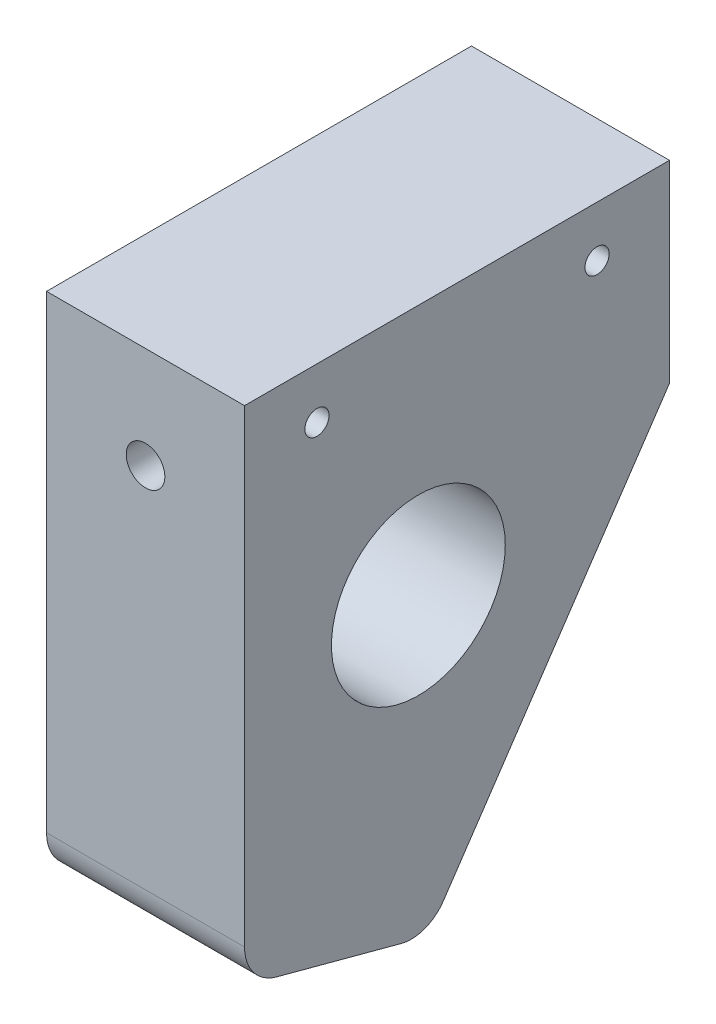
ISO-10303-21;
HEADER;
FILE_DESCRIPTION(('STEP AP214'),'2;1');
FILE_NAME('part.step','',(''),(''),'','','');
FILE_SCHEMA(('AUTOMOTIVE_DESIGN { 1 0 10303 214 1 1 1 1 }'));
ENDSEC;
DATA;
#1=APPLICATION_CONTEXT('core data for automotive mechanical design processes');
#2=APPLICATION_PROTOCOL_DEFINITION('international standard','automotive_design',2000,#1);
#3=PRODUCT_CONTEXT('',#1,'mechanical');
#4=PRODUCT('Part','Part','',(#3));
#5=PRODUCT_RELATED_PRODUCT_CATEGORY('part','',(#4));
#6=PRODUCT_DEFINITION_FORMATION('','',#4);
#7=PRODUCT_DEFINITION_CONTEXT('part definition',#1,'design');
#8=PRODUCT_DEFINITION('design','',#6,#7);
#9=PRODUCT_DEFINITION_SHAPE('','',#8);
#10=(LENGTH_UNIT() NAMED_UNIT(*) SI_UNIT(.MILLI.,.METRE.));
#11=(NAMED_UNIT(*) PLANE_ANGLE_UNIT() SI_UNIT($,.RADIAN.));
#12=(NAMED_UNIT(*) SI_UNIT($,.STERADIAN.) SOLID_ANGLE_UNIT());
#13=UNCERTAINTY_MEASURE_WITH_UNIT(LENGTH_MEASURE(1.E-05),#10,'distance_accuracy_value','');
#14=(GEOMETRIC_REPRESENTATION_CONTEXT(3) GLOBAL_UNCERTAINTY_ASSIGNED_CONTEXT((#13)) GLOBAL_UNIT_ASSIGNED_CONTEXT((#10,
#11,#12)) REPRESENTATION_CONTEXT('',''));
#15=CARTESIAN_POINT('',(0.,0.,0.));
#16=DIRECTION('',(0.,0.,1.));
#17=DIRECTION('',(1.,0.,0.));
#18=AXIS2_PLACEMENT_3D('',#15,#16,#17);
#19=CARTESIAN_POINT('',(10.25,-52.4847415611923,26.736106644465));
#20=DIRECTION('',(1.,0.,0.));
#21=DIRECTION('',(0.,0.,-1.));
#22=AXIS2_PLACEMENT_3D('',#19,#20,#21);
#23=PLANE('',#22);
#24=CARTESIAN_POINT('',(10.25,-5.25,7.5));
#25=DIRECTION('',(1.,0.,0.));
#26=DIRECTION('',(0.,0.,1.));
#27=AXIS2_PLACEMENT_3D('',#24,#25,#26);
#28=CIRCLE('',#27,1.25);
#29=CARTESIAN_POINT('',(10.25,-5.25,8.75));
#30=VERTEX_POINT('',#29);
#31=EDGE_CURVE('E166',#30,#30,#28,.T.);
#32=ORIENTED_EDGE('',*,*,#31,.F.);
#33=EDGE_LOOP('',(#32));
#34=FACE_BOUND('',#33,.T.);
#35=DIRECTION('',(0.,0.,1.));
#36=VECTOR('',#35,1.);
#37=CARTESIAN_POINT('',(10.25,0.,44.));
#38=LINE('',#37,#36);
#39=CARTESIAN_POINT('',(10.25,0.,0.));
#40=VERTEX_POINT('',#39);
#41=CARTESIAN_POINT('',(10.25,0.,44.));
#42=VERTEX_POINT('',#41);
#43=EDGE_CURVE('E139',#40,#42,#38,.T.);
#44=ORIENTED_EDGE('',*,*,#43,.T.);
#45=DIRECTION('',(0.,-1.,0.));
#46=VECTOR('',#45,1.);
#47=CARTESIAN_POINT('',(10.25,0.,44.));
#48=LINE('',#47,#46);
#49=CARTESIAN_POINT('',(10.25,-48.5470285540947,44.));
#50=VERTEX_POINT('',#49);
#51=EDGE_CURVE('E92',#42,#50,#48,.T.);
#52=ORIENTED_EDGE('',*,*,#51,.T.);
#53=CARTESIAN_POINT('',(10.25,-48.5470285540947,39.5));
#54=DIRECTION('',(1.,0.,0.));
#55=DIRECTION('',(0.,0.,-1.));
#56=AXIS2_PLACEMENT_3D('',#53,#54,#55);
#57=CIRCLE('',#56,4.5);
#58=CARTESIAN_POINT('',(10.25,-52.8936947723955,40.6646857029614));
#59=VERTEX_POINT('',#58);
#60=EDGE_CURVE('E151',#50,#59,#57,.T.);
#61=ORIENTED_EDGE('',*,*,#60,.T.);
#62=DIRECTION('',(0.,-0.258819045102525,-0.965925826289067));
#63=VECTOR('',#62,1.);
#64=CARTESIAN_POINT('',(10.25,-56.3484448663486,27.7713828248752));
#65=LINE('',#64,#63);
#66=CARTESIAN_POINT('',(10.25,-56.3484448663486,27.7713828248752));
#67=VERTEX_POINT('',#66);
#68=EDGE_CURVE('E108',#59,#67,#65,.T.);
#69=ORIENTED_EDGE('',*,*,#68,.T.);
#70=CARTESIAN_POINT('',(10.25,-52.4847415611923,26.736106644465));
#71=DIRECTION('',(1.,0.,0.));
#72=DIRECTION('',(0.,0.,-1.));
#73=AXIS2_PLACEMENT_3D('',#70,#71,#72);
#74=CIRCLE('',#73,4.);
#75=CARTESIAN_POINT('',(10.25,-54.7215131750753,23.4199563542449));
#76=VERTEX_POINT('',#75);
#77=EDGE_CURVE('E102',#67,#76,#74,.T.);
#78=ORIENTED_EDGE('',*,*,#77,.T.);
#79=DIRECTION('',(0.,0.829037572555041,-0.559192903470748));
#80=VECTOR('',#79,1.);
#81=CARTESIAN_POINT('',(10.25,-20.,0.));
#82=LINE('',#81,#80);
#83=CARTESIAN_POINT('',(10.25,-20.,0.));
#84=VERTEX_POINT('',#83);
#85=EDGE_CURVE('E106',#76,#84,#82,.T.);
#86=ORIENTED_EDGE('',*,*,#85,.T.);
#87=DIRECTION('',(0.,1.,0.));
#88=VECTOR('',#87,1.);
#89=CARTESIAN_POINT('',(10.25,0.,0.));
#90=LINE('',#89,#88);
#91=EDGE_CURVE('E52',#84,#40,#90,.T.);
#92=ORIENTED_EDGE('',*,*,#91,.T.);
#93=EDGE_LOOP('',(#44,#52,#61,#69,#78,#86,#92));
#94=FACE_BOUND('',#93,.T.);
#95=CARTESIAN_POINT('',(10.25,-26.,26.));
#96=DIRECTION('',(1.,0.,0.));
#97=DIRECTION('',(0.,0.,-1.));
#98=AXIS2_PLACEMENT_3D('',#95,#96,#97);
#99=CIRCLE('',#98,9.);
#100=CARTESIAN_POINT('',(10.25,-26.,17.));
#101=VERTEX_POINT('',#100);
#102=EDGE_CURVE('E130',#101,#101,#99,.T.);
#103=ORIENTED_EDGE('',*,*,#102,.F.);
#104=EDGE_LOOP('',(#103));
#105=FACE_BOUND('',#104,.T.);
#106=CARTESIAN_POINT('',(10.25,-5.25,36.5));
#107=DIRECTION('',(1.,0.,0.));
#108=DIRECTION('',(0.,0.,-1.));
#109=AXIS2_PLACEMENT_3D('',#106,#107,#108);
#110=CIRCLE('',#109,1.25);
#111=CARTESIAN_POINT('',(10.25,-5.25,35.25));
#112=VERTEX_POINT('',#111);
#113=EDGE_CURVE('E172',#112,#112,#110,.T.);
#114=ORIENTED_EDGE('',*,*,#113,.F.);
#115=EDGE_LOOP('',(#114));
#116=FACE_BOUND('',#115,.T.);
#117=ADVANCED_FACE('F35',(#34,#94,#105,#116),#23,.T.);
#118=CARTESIAN_POINT('',(-10.25,-52.4847415611923,26.736106644465));
#119=DIRECTION('',(1.,0.,0.));
#120=DIRECTION('',(0.,0.,-1.));
#121=AXIS2_PLACEMENT_3D('',#118,#119,#120);
#122=PLANE('',#121);
#123=DIRECTION('',(0.,0.,1.));
#124=VECTOR('',#123,1.);
#125=CARTESIAN_POINT('',(-10.25,0.,44.));
#126=LINE('',#125,#124);
#127=CARTESIAN_POINT('',(-10.25,0.,0.));
#128=VERTEX_POINT('',#127);
#129=CARTESIAN_POINT('',(-10.25,0.,44.));
#130=VERTEX_POINT('',#129);
#131=EDGE_CURVE('E126',#128,#130,#126,.T.);
#132=ORIENTED_EDGE('',*,*,#131,.F.);
#133=DIRECTION('',(0.,1.,0.));
#134=VECTOR('',#133,1.);
#135=CARTESIAN_POINT('',(-10.25,0.,0.));
#136=LINE('',#135,#134);
#137=CARTESIAN_POINT('',(-10.25,-20.,0.));
#138=VERTEX_POINT('',#137);
#139=EDGE_CURVE('E84',#138,#128,#136,.T.);
#140=ORIENTED_EDGE('',*,*,#139,.F.);
#141=DIRECTION('',(0.,0.829037572555041,-0.559192903470748));
#142=VECTOR('',#141,1.);
#143=CARTESIAN_POINT('',(-10.25,-20.,0.));
#144=LINE('',#143,#142);
#145=CARTESIAN_POINT('',(-10.25,-54.7215131750753,23.4199563542449));
#146=VERTEX_POINT('',#145);
#147=EDGE_CURVE('E78',#146,#138,#144,.T.);
#148=ORIENTED_EDGE('',*,*,#147,.F.);
#149=CARTESIAN_POINT('',(-10.25,-52.4847415611923,26.736106644465));
#150=DIRECTION('',(1.,0.,0.));
#151=DIRECTION('',(0.,0.,-1.));
#152=AXIS2_PLACEMENT_3D('',#149,#150,#151);
#153=CIRCLE('',#152,4.);
#154=CARTESIAN_POINT('',(-10.25,-56.3484448663486,27.7713828248752));
#155=VERTEX_POINT('',#154);
#156=EDGE_CURVE('E116',#155,#146,#153,.T.);
#157=ORIENTED_EDGE('',*,*,#156,.F.);
#158=DIRECTION('',(0.,-0.258819045102525,-0.965925826289067));
#159=VECTOR('',#158,1.);
#160=CARTESIAN_POINT('',(-10.25,-56.3484448663486,27.7713828248752));
#161=LINE('',#160,#159);
#162=CARTESIAN_POINT('',(-10.25,-52.8936947723955,40.6646857029614));
#163=VERTEX_POINT('',#162);
#164=EDGE_CURVE('E134',#163,#155,#161,.T.);
#165=ORIENTED_EDGE('',*,*,#164,.F.);
#166=CARTESIAN_POINT('',(-10.25,-48.5470285540947,39.5));
#167=DIRECTION('',(1.,0.,0.));
#168=DIRECTION('',(0.,0.,-1.));
#169=AXIS2_PLACEMENT_3D('',#166,#167,#168);
#170=CIRCLE('',#169,4.5);
#171=CARTESIAN_POINT('',(-10.25,-48.5470285540947,44.));
#172=VERTEX_POINT('',#171);
#173=EDGE_CURVE('E132',#172,#163,#170,.T.);
#174=ORIENTED_EDGE('',*,*,#173,.F.);
#175=DIRECTION('',(0.,-1.,0.));
#176=VECTOR('',#175,1.);
#177=CARTESIAN_POINT('',(-10.25,0.,44.));
#178=LINE('',#177,#176);
#179=EDGE_CURVE('E129',#130,#172,#178,.T.);
#180=ORIENTED_EDGE('',*,*,#179,.F.);
#181=EDGE_LOOP('',(#132,#140,#148,#157,#165,#174,#180));
#182=FACE_BOUND('',#181,.T.);
#183=CARTESIAN_POINT('',(-10.25,-26.,26.));
#184=DIRECTION('',(1.,0.,0.));
#185=DIRECTION('',(0.,0.,-1.));
#186=AXIS2_PLACEMENT_3D('',#183,#184,#185);
#187=CIRCLE('',#186,9.);
#188=CARTESIAN_POINT('',(-10.25,-26.,17.));
#189=VERTEX_POINT('',#188);
#190=EDGE_CURVE('E163',#189,#189,#187,.T.);
#191=ORIENTED_EDGE('',*,*,#190,.T.);
#192=EDGE_LOOP('',(#191));
#193=FACE_BOUND('',#192,.T.);
#194=CARTESIAN_POINT('',(-10.25,-5.25,7.5));
#195=DIRECTION('',(1.,0.,0.));
#196=DIRECTION('',(0.,0.,1.));
#197=AXIS2_PLACEMENT_3D('',#194,#195,#196);
#198=CIRCLE('',#197,1.25);
#199=CARTESIAN_POINT('',(-10.25,-5.25,8.75));
#200=VERTEX_POINT('',#199);
#201=EDGE_CURVE('E169',#200,#200,#198,.T.);
#202=ORIENTED_EDGE('',*,*,#201,.T.);
#203=EDGE_LOOP('',(#202));
#204=FACE_BOUND('',#203,.T.);
#205=CARTESIAN_POINT('',(-10.25,-5.25,36.5));
#206=DIRECTION('',(1.,0.,0.));
#207=DIRECTION('',(0.,0.,-1.));
#208=AXIS2_PLACEMENT_3D('',#205,#206,#207);
#209=CIRCLE('',#208,1.25);
#210=CARTESIAN_POINT('',(-10.25,-5.25,35.25));
#211=VERTEX_POINT('',#210);
#212=EDGE_CURVE('E175',#211,#211,#209,.T.);
#213=ORIENTED_EDGE('',*,*,#212,.T.);
#214=EDGE_LOOP('',(#213));
#215=FACE_BOUND('',#214,.T.);
#216=ADVANCED_FACE('F155',(#182,#193,#204,#215),#122,.F.);
#217=CARTESIAN_POINT('',(10.25,0.,44.));
#218=DIRECTION('',(0.,-1.,0.));
#219=DIRECTION('',(0.,0.,-1.));
#220=AXIS2_PLACEMENT_3D('',#217,#218,#219);
#221=PLANE('',#220);
#222=ORIENTED_EDGE('',*,*,#131,.T.);
#223=DIRECTION('',(-1.,0.,0.));
#224=VECTOR('',#223,1.);
#225=CARTESIAN_POINT('',(10.25,0.,44.));
#226=LINE('',#225,#224);
#227=EDGE_CURVE('E11',#42,#130,#226,.T.);
#228=ORIENTED_EDGE('',*,*,#227,.F.);
#229=ORIENTED_EDGE('',*,*,#43,.F.);
#230=DIRECTION('',(-1.,0.,0.));
#231=VECTOR('',#230,1.);
#232=CARTESIAN_POINT('',(10.25,0.,0.));
#233=LINE('',#232,#231);
#234=EDGE_CURVE('E122',#40,#128,#233,.T.);
#235=ORIENTED_EDGE('',*,*,#234,.T.);
#236=EDGE_LOOP('',(#222,#228,#229,#235));
#237=FACE_BOUND('',#236,.T.);
#238=ADVANCED_FACE('F37',(#237),#221,.F.);
#239=CARTESIAN_POINT('',(10.25,0.,44.));
#240=DIRECTION('',(0.,0.,-1.));
#241=DIRECTION('',(0.,1.,0.));
#242=AXIS2_PLACEMENT_3D('',#239,#240,#241);
#243=PLANE('',#242);
#244=CARTESIAN_POINT('',(0.,-10.5,44.));
#245=DIRECTION('',(0.,0.,1.));
#246=DIRECTION('',(1.,0.,0.));
#247=AXIS2_PLACEMENT_3D('',#244,#245,#246);
#248=CIRCLE('',#247,2.);
#249=CARTESIAN_POINT('',(2.,-10.5,44.));
#250=VERTEX_POINT('',#249);
#251=EDGE_CURVE('E181',#250,#250,#248,.T.);
#252=ORIENTED_EDGE('',*,*,#251,.F.);
#253=EDGE_LOOP('',(#252));
#254=FACE_BOUND('',#253,.T.);
#255=ORIENTED_EDGE('',*,*,#179,.T.);
#256=DIRECTION('',(-1.,0.,0.));
#257=VECTOR('',#256,1.);
#258=CARTESIAN_POINT('',(10.25,-48.5470285540947,44.));
#259=LINE('',#258,#257);
#260=EDGE_CURVE('E44',#50,#172,#259,.T.);
#261=ORIENTED_EDGE('',*,*,#260,.F.);
#262=ORIENTED_EDGE('',*,*,#51,.F.);
#263=ORIENTED_EDGE('',*,*,#227,.T.);
#264=EDGE_LOOP('',(#255,#261,#262,#263));
#265=FACE_BOUND('',#264,.T.);
#266=ADVANCED_FACE('F196',(#254,#265),#243,.F.);
#267=CARTESIAN_POINT('',(10.25,-48.5470285540947,39.5));
#268=DIRECTION('',(-1.,0.,0.));
#269=DIRECTION('',(0.,0.,1.));
#270=AXIS2_PLACEMENT_3D('',#267,#268,#269);
#271=CYLINDRICAL_SURFACE('',#270,4.5);
#272=ORIENTED_EDGE('',*,*,#173,.T.);
#273=DIRECTION('',(-1.,0.,0.));
#274=VECTOR('',#273,1.);
#275=CARTESIAN_POINT('',(10.25,-52.8936947723955,40.6646857029614));
#276=LINE('',#275,#274);
#277=EDGE_CURVE('E143',#59,#163,#276,.T.);
#278=ORIENTED_EDGE('',*,*,#277,.F.);
#279=ORIENTED_EDGE('',*,*,#60,.F.);
#280=ORIENTED_EDGE('',*,*,#260,.T.);
#281=EDGE_LOOP('',(#272,#278,#279,#280));
#282=FACE_BOUND('',#281,.T.);
#283=ADVANCED_FACE('F149',(#282),#271,.T.);
#284=CARTESIAN_POINT('',(10.25,-56.3484448663486,27.7713828248752));
#285=DIRECTION('',(0.,0.965925826289067,-0.258819045102525));
#286=DIRECTION('',(0.,0.258819045102525,0.965925826289067));
#287=AXIS2_PLACEMENT_3D('',#284,#285,#286);
#288=PLANE('',#287);
#289=ORIENTED_EDGE('',*,*,#164,.T.);
#290=DIRECTION('',(-1.,0.,0.));
#291=VECTOR('',#290,1.);
#292=CARTESIAN_POINT('',(10.25,-56.3484448663486,27.7713828248752));
#293=LINE('',#292,#291);
#294=EDGE_CURVE('E117',#67,#155,#293,.T.);
#295=ORIENTED_EDGE('',*,*,#294,.F.);
#296=ORIENTED_EDGE('',*,*,#68,.F.);
#297=ORIENTED_EDGE('',*,*,#277,.T.);
#298=EDGE_LOOP('',(#289,#295,#296,#297));
#299=FACE_BOUND('',#298,.T.);
#300=ADVANCED_FACE('F158',(#299),#288,.F.);
#301=CARTESIAN_POINT('',(10.25,-52.4847415611923,26.736106644465));
#302=DIRECTION('',(-1.,0.,0.));
#303=DIRECTION('',(0.,0.,1.));
#304=AXIS2_PLACEMENT_3D('',#301,#302,#303);
#305=CYLINDRICAL_SURFACE('',#304,4.);
#306=ORIENTED_EDGE('',*,*,#156,.T.);
#307=DIRECTION('',(-1.,0.,0.));
#308=VECTOR('',#307,1.);
#309=CARTESIAN_POINT('',(10.25,-54.7215131750753,23.4199563542449));
#310=LINE('',#309,#308);
#311=EDGE_CURVE('E113',#76,#146,#310,.T.);
#312=ORIENTED_EDGE('',*,*,#311,.F.);
#313=ORIENTED_EDGE('',*,*,#77,.F.);
#314=ORIENTED_EDGE('',*,*,#294,.T.);
#315=EDGE_LOOP('',(#306,#312,#313,#314));
#316=FACE_BOUND('',#315,.T.);
#317=ADVANCED_FACE('F114',(#316),#305,.T.);
#318=CARTESIAN_POINT('',(10.25,-20.,0.));
#319=DIRECTION('',(0.,0.559192903470748,0.829037572555041));
#320=DIRECTION('',(0.,-0.829037572555041,0.559192903470748));
#321=AXIS2_PLACEMENT_3D('',#318,#319,#320);
#322=PLANE('',#321);
#323=ORIENTED_EDGE('',*,*,#147,.T.);
#324=DIRECTION('',(-1.,0.,0.));
#325=VECTOR('',#324,1.);
#326=CARTESIAN_POINT('',(10.25,-20.,0.));
#327=LINE('',#326,#325);
#328=EDGE_CURVE('E118',#84,#138,#327,.T.);
#329=ORIENTED_EDGE('',*,*,#328,.F.);
#330=ORIENTED_EDGE('',*,*,#85,.F.);
#331=ORIENTED_EDGE('',*,*,#311,.T.);
#332=EDGE_LOOP('',(#323,#329,#330,#331));
#333=FACE_BOUND('',#332,.T.);
#334=ADVANCED_FACE('F120',(#333),#322,.F.);
#335=CARTESIAN_POINT('',(10.25,0.,0.));
#336=DIRECTION('',(0.,0.,1.));
#337=DIRECTION('',(0.,-1.,0.));
#338=AXIS2_PLACEMENT_3D('',#335,#336,#337);
#339=PLANE('',#338);
#340=CARTESIAN_POINT('',(0.,-10.5,0.));
#341=DIRECTION('',(0.,0.,1.));
#342=DIRECTION('',(1.,0.,0.));
#343=AXIS2_PLACEMENT_3D('',#340,#341,#342);
#344=CIRCLE('',#343,2.);
#345=CARTESIAN_POINT('',(2.,-10.5,0.));
#346=VERTEX_POINT('',#345);
#347=EDGE_CURVE('E178',#346,#346,#344,.T.);
#348=ORIENTED_EDGE('',*,*,#347,.T.);
#349=EDGE_LOOP('',(#348));
#350=FACE_BOUND('',#349,.T.);
#351=ORIENTED_EDGE('',*,*,#139,.T.);
#352=ORIENTED_EDGE('',*,*,#234,.F.);
#353=ORIENTED_EDGE('',*,*,#91,.F.);
#354=ORIENTED_EDGE('',*,*,#328,.T.);
#355=EDGE_LOOP('',(#351,#352,#353,#354));
#356=FACE_BOUND('',#355,.T.);
#357=ADVANCED_FACE('F187',(#350,#356),#339,.F.);
#358=CARTESIAN_POINT('',(10.25,-26.,26.));
#359=DIRECTION('',(-1.,0.,0.));
#360=DIRECTION('',(0.,0.,1.));
#361=AXIS2_PLACEMENT_3D('',#358,#359,#360);
#362=CYLINDRICAL_SURFACE('',#361,9.);
#363=ORIENTED_EDGE('',*,*,#102,.T.);
#364=EDGE_LOOP('',(#363));
#365=FACE_BOUND('',#364,.T.);
#366=ORIENTED_EDGE('',*,*,#190,.F.);
#367=EDGE_LOOP('',(#366));
#368=FACE_BOUND('',#367,.T.);
#369=ADVANCED_FACE('F202',(#365,#368),#362,.F.);
#370=CARTESIAN_POINT('',(10.25,-5.25,7.5));
#371=DIRECTION('',(-1.,0.,0.));
#372=DIRECTION('',(0.,0.,1.));
#373=AXIS2_PLACEMENT_3D('',#370,#371,#372);
#374=CYLINDRICAL_SURFACE('',#373,1.25);
#375=ORIENTED_EDGE('',*,*,#31,.T.);
#376=EDGE_LOOP('',(#375));
#377=FACE_BOUND('',#376,.T.);
#378=ORIENTED_EDGE('',*,*,#201,.F.);
#379=EDGE_LOOP('',(#378));
#380=FACE_BOUND('',#379,.T.);
#381=ADVANCED_FACE('F208',(#377,#380),#374,.F.);
#382=CARTESIAN_POINT('',(10.25,-5.25,36.5));
#383=DIRECTION('',(-1.,0.,0.));
#384=DIRECTION('',(0.,0.,1.));
#385=AXIS2_PLACEMENT_3D('',#382,#383,#384);
#386=CYLINDRICAL_SURFACE('',#385,1.25);
#387=ORIENTED_EDGE('',*,*,#113,.T.);
#388=EDGE_LOOP('',(#387));
#389=FACE_BOUND('',#388,.T.);
#390=ORIENTED_EDGE('',*,*,#212,.F.);
#391=EDGE_LOOP('',(#390));
#392=FACE_BOUND('',#391,.T.);
#393=ADVANCED_FACE('F192',(#389,#392),#386,.F.);
#394=CARTESIAN_POINT('',(0.,-10.5,0.));
#395=DIRECTION('',(0.,0.,1.));
#396=DIRECTION('',(1.,0.,0.));
#397=AXIS2_PLACEMENT_3D('',#394,#395,#396);
#398=CYLINDRICAL_SURFACE('',#397,2.);
#399=ORIENTED_EDGE('',*,*,#347,.F.);
#400=EDGE_LOOP('',(#399));
#401=FACE_BOUND('',#400,.T.);
#402=ORIENTED_EDGE('',*,*,#251,.T.);
#403=EDGE_LOOP('',(#402));
#404=FACE_BOUND('',#403,.T.);
#405=ADVANCED_FACE('F189',(#401,#404),#398,.F.);
#406=CLOSED_SHELL('',(#117,#216,#238,#266,#283,#300,#317,#334,#357,#369,#381,#393,#405));
#407=MANIFOLD_SOLID_BREP('B2',#406);
#408=ADVANCED_BREP_SHAPE_REPRESENTATION('',(#18,#407),#14);
#409=SHAPE_DEFINITION_REPRESENTATION(#9,#408);
ENDSEC;
END-ISO-10303-21;
